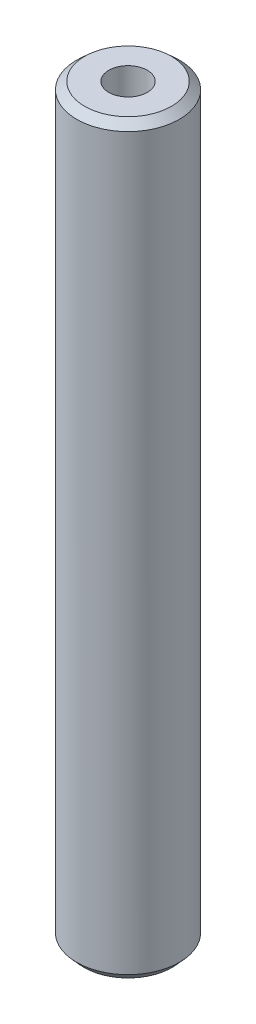
ISO-10303-21;
HEADER;
FILE_DESCRIPTION(('STEP AP214'),'2;1');
FILE_NAME('part.step','',(''),(''),'','','');
FILE_SCHEMA(('AUTOMOTIVE_DESIGN { 1 0 10303 214 1 1 1 1 }'));
ENDSEC;
DATA;
#1=APPLICATION_CONTEXT('core data for automotive mechanical design processes');
#2=APPLICATION_PROTOCOL_DEFINITION('international standard','automotive_design',2000,#1);
#3=PRODUCT_CONTEXT('',#1,'mechanical');
#4=PRODUCT('Part','Part','',(#3));
#5=PRODUCT_RELATED_PRODUCT_CATEGORY('part','',(#4));
#6=PRODUCT_DEFINITION_FORMATION('','',#4);
#7=PRODUCT_DEFINITION_CONTEXT('part definition',#1,'design');
#8=PRODUCT_DEFINITION('design','',#6,#7);
#9=PRODUCT_DEFINITION_SHAPE('','',#8);
#10=(LENGTH_UNIT() NAMED_UNIT(*) SI_UNIT(.MILLI.,.METRE.));
#11=(NAMED_UNIT(*) PLANE_ANGLE_UNIT() SI_UNIT($,.RADIAN.));
#12=(NAMED_UNIT(*) SI_UNIT($,.STERADIAN.) SOLID_ANGLE_UNIT());
#13=UNCERTAINTY_MEASURE_WITH_UNIT(LENGTH_MEASURE(1.E-05),#10,'distance_accuracy_value','');
#14=(GEOMETRIC_REPRESENTATION_CONTEXT(3) GLOBAL_UNCERTAINTY_ASSIGNED_CONTEXT((#13)) GLOBAL_UNIT_ASSIGNED_CONTEXT((#10,
#11,#12)) REPRESENTATION_CONTEXT('',''));
#15=CARTESIAN_POINT('',(0.,0.,0.));
#16=DIRECTION('',(0.,0.,1.));
#17=DIRECTION('',(1.,0.,0.));
#18=AXIS2_PLACEMENT_3D('',#15,#16,#17);
#19=CARTESIAN_POINT('',(0.,290.200484392078,0.));
#20=DIRECTION('',(0.,-1.,0.));
#21=DIRECTION('',(0.,0.,-1.));
#22=AXIS2_PLACEMENT_3D('',#19,#20,#21);
#23=CYLINDRICAL_SURFACE('',#22,20.);
#24=CARTESIAN_POINT('',(0.,287.378357114849,0.));
#25=DIRECTION('',(0.,1.,0.));
#26=DIRECTION('',(0.,0.,1.));
#27=AXIS2_PLACEMENT_3D('',#24,#25,#26);
#28=CIRCLE('',#27,20.);
#29=CARTESIAN_POINT('',(0.,287.378357114849,-20.));
#30=VERTEX_POINT('',#29);
#31=EDGE_CURVE('E50',#30,#30,#28,.F.);
#32=CARTESIAN_POINT('',(0.,3.1256314483481,0.));
#33=DIRECTION('',(0.,1.,0.));
#34=DIRECTION('',(0.,0.,1.));
#35=AXIS2_PLACEMENT_3D('',#32,#33,#34);
#36=CIRCLE('',#35,20.);
#37=CARTESIAN_POINT('',(0.,3.12563144834804,-20.));
#38=VERTEX_POINT('',#37);
#39=EDGE_CURVE('E51',#38,#38,#36,.T.);
#40=CARTESIAN_POINT('',(0.,287.378357114849,-20.));
#41=CARTESIAN_POINT('',(0.,284.41739122249,-20.));
#42=CARTESIAN_POINT('',(0.,281.45642533013,-20.));
#43=CARTESIAN_POINT('',(0.,275.534493545412,-20.));
#44=CARTESIAN_POINT('',(0.,272.573527653052,-20.));
#45=CARTESIAN_POINT('',(0.,266.651595868333,-20.));
#46=CARTESIAN_POINT('',(0.,263.690629975974,-20.));
#47=CARTESIAN_POINT('',(0.,257.768698191255,-20.));
#48=CARTESIAN_POINT('',(0.,254.807732298896,-20.));
#49=CARTESIAN_POINT('',(0.,248.885800514177,-20.));
#50=CARTESIAN_POINT('',(0.,245.924834621818,-20.));
#51=CARTESIAN_POINT('',(0.,240.002902837099,-20.));
#52=CARTESIAN_POINT('',(0.,237.04193694474,-20.));
#53=CARTESIAN_POINT('',(0.,231.120005160021,-20.));
#54=CARTESIAN_POINT('',(0.,228.159039267661,-20.));
#55=CARTESIAN_POINT('',(0.,222.237107482943,-20.));
#56=CARTESIAN_POINT('',(0.,219.276141590583,-20.));
#57=CARTESIAN_POINT('',(0.,213.354209805864,-20.));
#58=CARTESIAN_POINT('',(0.,210.393243913505,-20.));
#59=CARTESIAN_POINT('',(0.,204.471312128786,-20.));
#60=CARTESIAN_POINT('',(0.,201.510346236427,-20.));
#61=CARTESIAN_POINT('',(0.,195.588414451708,-20.));
#62=CARTESIAN_POINT('',(0.,192.627448559349,-20.));
#63=CARTESIAN_POINT('',(0.,186.70551677463,-20.));
#64=CARTESIAN_POINT('',(0.,183.744550882271,-20.));
#65=CARTESIAN_POINT('',(0.,177.822619097552,-20.));
#66=CARTESIAN_POINT('',(0.,174.861653205192,-20.));
#67=CARTESIAN_POINT('',(0.,168.939721420474,-20.));
#68=CARTESIAN_POINT('',(0.,165.978755528114,-20.));
#69=CARTESIAN_POINT('',(0.,160.056823743396,-20.));
#70=CARTESIAN_POINT('',(0.,157.095857851036,-20.));
#71=CARTESIAN_POINT('',(0.,151.173926066317,-20.));
#72=CARTESIAN_POINT('',(0.,148.212960173958,-20.));
#73=CARTESIAN_POINT('',(0.,142.291028389239,-20.));
#74=CARTESIAN_POINT('',(0.,139.33006249688,-20.));
#75=CARTESIAN_POINT('',(0.,133.408130712161,-20.));
#76=CARTESIAN_POINT('',(0.,130.447164819802,-20.));
#77=CARTESIAN_POINT('',(0.,124.525233035083,-20.));
#78=CARTESIAN_POINT('',(0.,121.564267142723,-20.));
#79=CARTESIAN_POINT('',(0.,115.642335358005,-20.));
#80=CARTESIAN_POINT('',(0.,112.681369465645,-20.));
#81=CARTESIAN_POINT('',(0.,106.759437680927,-20.));
#82=CARTESIAN_POINT('',(0.,103.798471788567,-20.));
#83=CARTESIAN_POINT('',(0.,97.8765400038484,-20.));
#84=CARTESIAN_POINT('',(0.,94.915574111489,-20.));
#85=CARTESIAN_POINT('',(0.,88.9936423267702,-20.));
#86=CARTESIAN_POINT('',(0.,86.0326764344109,-20.));
#87=CARTESIAN_POINT('',(0.,80.1107446496921,-20.));
#88=CARTESIAN_POINT('',(0.,77.1497787573327,-20.));
#89=CARTESIAN_POINT('',(0.,71.2278469726139,-20.));
#90=CARTESIAN_POINT('',(0.,68.2668810802545,-20.));
#91=CARTESIAN_POINT('',(0.,62.3449492955358,-20.));
#92=CARTESIAN_POINT('',(0.,59.3839834031764,-20.));
#93=CARTESIAN_POINT('',(0.,53.4620516184576,-20.));
#94=CARTESIAN_POINT('',(0.,50.5010857260982,-20.));
#95=CARTESIAN_POINT('',(0.,44.5791539413795,-20.));
#96=CARTESIAN_POINT('',(0.,41.6181880490201,-20.));
#97=CARTESIAN_POINT('',(0.,35.6962562643013,-20.));
#98=CARTESIAN_POINT('',(0.,32.735290371942,-20.));
#99=CARTESIAN_POINT('',(0.,26.8133585872232,-20.));
#100=CARTESIAN_POINT('',(0.,23.8523926948638,-20.));
#101=CARTESIAN_POINT('',(0.,17.930460910145,-20.));
#102=CARTESIAN_POINT('',(0.,14.9694950177856,-20.));
#103=CARTESIAN_POINT('',(0.,9.04756323306682,-20.));
#104=CARTESIAN_POINT('',(0.,6.08659734070743,-20.));
#105=CARTESIAN_POINT('',(0.,3.12563144834804,-20.));
#106=B_SPLINE_CURVE_WITH_KNOTS('',3,(#40,#41,#42,#43,#44,#45,#46,#47,#48,#49,#50,#51,#52,#53,
#54,#55,#56,#57,#58,#59,#60,#61,#62,#63,#64,#65,#66,#67,#68,#69,#70,#71,#72,#73,#74,#75,#76,#77,
#78,#79,#80,#81,#82,#83,#84,#85,#86,#87,#88,#89,#90,#91,#92,#93,#94,#95,#96,#97,#98,#99,#100,
#101,#102,#103,#104,#105),.UNSPECIFIED.,.F.,.F.,(4,2,2,2,2,2,2,2,2,2,2,2,2,2,2,2,2,2,2,2,2,2,2,
2,2,2,2,2,2,2,2,2,4),(0.,8.88289767707817,17.7657953541563,26.6486930312345,35.5315907083126,
44.4144883853908,53.297386062469,62.1802837395471,71.0631814166253,79.9460790937034,
88.8289767707816,97.7118744478598,106.594772124938,115.477669802016,124.360567479094,
133.243465156172,142.126362833251,151.009260510329,159.892158187407,168.775055864485,
177.657953541563,186.540851218641,195.423748895719,204.306646572798,213.189544249876,
222.072441926954,230.955339604032,239.83823728111,248.721134958188,257.604032635267,
266.486930312345,275.369827989423,284.252725666501),.UNSPECIFIED.);
#107=EDGE_CURVE('BSEAM39',#30,#38,#106,.T.);
#108=ORIENTED_EDGE('',*,*,#31,.T.);
#109=ORIENTED_EDGE('',*,*,#39,.T.);
#110=ORIENTED_EDGE('',*,*,#107,.T.);
#111=ORIENTED_EDGE('',*,*,#107,.F.);
#112=EDGE_LOOP('',(#108,#110,#109,#111));
#113=FACE_BOUND('',#112,.T.);
#114=ADVANCED_FACE('F39',(#113),#23,.T.);
#115=CARTESIAN_POINT('',(0.,290.200484392078,0.));
#116=DIRECTION('',(0.,1.,0.));
#117=DIRECTION('',(0.,0.,1.));
#118=AXIS2_PLACEMENT_3D('',#115,#116,#117);
#119=PLANE('',#118);
#120=CARTESIAN_POINT('',(0.,290.200484392078,0.));
#121=DIRECTION('',(0.,1.,0.));
#122=DIRECTION('',(0.,0.,1.));
#123=AXIS2_PLACEMENT_3D('',#120,#121,#122);
#124=CIRCLE('',#123,16.8743685516522);
#125=CARTESIAN_POINT('',(0.,290.200484392078,16.8743685516522));
#126=VERTEX_POINT('',#125);
#127=EDGE_CURVE('E54',#126,#126,#124,.T.);
#128=ORIENTED_EDGE('',*,*,#127,.T.);
#129=EDGE_LOOP('',(#128));
#130=FACE_BOUND('',#129,.T.);
#131=CARTESIAN_POINT('',(0.,290.200484392078,0.));
#132=DIRECTION('',(0.,1.,0.));
#133=DIRECTION('',(0.,0.,1.));
#134=AXIS2_PLACEMENT_3D('',#131,#132,#133);
#135=CIRCLE('',#134,7.48569003703351);
#136=CARTESIAN_POINT('',(0.,290.200484392078,-7.48569003703351));
#137=VERTEX_POINT('',#136);
#138=EDGE_CURVE('E58',#137,#137,#135,.T.);
#139=ORIENTED_EDGE('',*,*,#138,.F.);
#140=EDGE_LOOP('',(#139));
#141=FACE_BOUND('',#140,.T.);
#142=ADVANCED_FACE('F69',(#130,#141),#119,.T.);
#143=CARTESIAN_POINT('',(0.,0.,0.));
#144=DIRECTION('',(0.,1.,0.));
#145=DIRECTION('',(0.,0.,1.));
#146=AXIS2_PLACEMENT_3D('',#143,#144,#145);
#147=PLANE('',#146);
#148=CARTESIAN_POINT('',(0.,0.,0.));
#149=DIRECTION('',(0.,1.,0.));
#150=DIRECTION('',(0.,0.,1.));
#151=AXIS2_PLACEMENT_3D('',#148,#149,#150);
#152=CIRCLE('',#151,17.1778727227708);
#153=CARTESIAN_POINT('',(0.,0.,17.1778727227708));
#154=VERTEX_POINT('',#153);
#155=EDGE_CURVE('E10',#154,#154,#152,.F.);
#156=ORIENTED_EDGE('',*,*,#155,.T.);
#157=EDGE_LOOP('',(#156));
#158=FACE_BOUND('',#157,.T.);
#159=CARTESIAN_POINT('',(0.,0.,0.));
#160=DIRECTION('',(0.,1.,0.));
#161=DIRECTION('',(0.,0.,1.));
#162=AXIS2_PLACEMENT_3D('',#159,#160,#161);
#163=CIRCLE('',#162,7.48569003703351);
#164=CARTESIAN_POINT('',(0.,0.,-7.48569003703351));
#165=VERTEX_POINT('',#164);
#166=EDGE_CURVE('E63',#165,#165,#163,.T.);
#167=ORIENTED_EDGE('',*,*,#166,.T.);
#168=EDGE_LOOP('',(#167));
#169=FACE_BOUND('',#168,.T.);
#170=ADVANCED_FACE('F75',(#158,#169),#147,.F.);
#171=CARTESIAN_POINT('',(0.,290.200484392078,0.));
#172=DIRECTION('',(0.,-1.,0.));
#173=DIRECTION('',(0.,0.,-1.));
#174=AXIS2_PLACEMENT_3D('',#171,#172,#173);
#175=CYLINDRICAL_SURFACE('',#174,7.48569003703351);
#176=CARTESIAN_POINT('',(0.,290.200484392078,-7.48569003703351));
#177=CARTESIAN_POINT('',(0.,287.177562679661,-7.48569003703351));
#178=CARTESIAN_POINT('',(0.,284.154640967243,-7.48569003703351));
#179=CARTESIAN_POINT('',(0.,278.108797542408,-7.48569003703351));
#180=CARTESIAN_POINT('',(0.,275.085875829991,-7.48569003703351));
#181=CARTESIAN_POINT('',(0.,269.040032405156,-7.48569003703351));
#182=CARTESIAN_POINT('',(0.,266.017110692738,-7.48569003703351));
#183=CARTESIAN_POINT('',(0.,259.971267267903,-7.48569003703351));
#184=CARTESIAN_POINT('',(0.,256.948345555486,-7.48569003703351));
#185=CARTESIAN_POINT('',(0.,250.902502130651,-7.48569003703351));
#186=CARTESIAN_POINT('',(0.,247.879580418233,-7.48569003703351));
#187=CARTESIAN_POINT('',(0.,241.833736993398,-7.48569003703351));
#188=CARTESIAN_POINT('',(0.,238.810815280981,-7.48569003703351));
#189=CARTESIAN_POINT('',(0.,232.764971856146,-7.48569003703351));
#190=CARTESIAN_POINT('',(0.,229.742050143728,-7.48569003703351));
#191=CARTESIAN_POINT('',(0.,223.696206718893,-7.48569003703351));
#192=CARTESIAN_POINT('',(0.,220.673285006476,-7.48569003703351));
#193=CARTESIAN_POINT('',(0.,214.627441581641,-7.48569003703351));
#194=CARTESIAN_POINT('',(0.,211.604519869224,-7.48569003703351));
#195=CARTESIAN_POINT('',(0.,205.558676444389,-7.48569003703351));
#196=CARTESIAN_POINT('',(0.,202.535754731971,-7.48569003703351));
#197=CARTESIAN_POINT('',(0.,196.489911307136,-7.48569003703351));
#198=CARTESIAN_POINT('',(0.,193.466989594719,-7.48569003703351));
#199=CARTESIAN_POINT('',(0.,187.421146169884,-7.48569003703351));
#200=CARTESIAN_POINT('',(0.,184.398224457466,-7.48569003703351));
#201=CARTESIAN_POINT('',(0.,178.352381032631,-7.48569003703351));
#202=CARTESIAN_POINT('',(0.,175.329459320214,-7.48569003703351));
#203=CARTESIAN_POINT('',(0.,169.283615895379,-7.48569003703351));
#204=CARTESIAN_POINT('',(0.,166.260694182961,-7.48569003703351));
#205=CARTESIAN_POINT('',(0.,160.214850758126,-7.48569003703351));
#206=CARTESIAN_POINT('',(0.,157.191929045709,-7.48569003703351));
#207=CARTESIAN_POINT('',(0.,151.146085620874,-7.48569003703351));
#208=CARTESIAN_POINT('',(0.,148.123163908456,-7.48569003703351));
#209=CARTESIAN_POINT('',(0.,142.077320483621,-7.48569003703351));
#210=CARTESIAN_POINT('',(0.,139.054398771204,-7.48569003703351));
#211=CARTESIAN_POINT('',(0.,133.008555346369,-7.48569003703351));
#212=CARTESIAN_POINT('',(0.,129.985633633952,-7.48569003703351));
#213=CARTESIAN_POINT('',(0.,123.939790209117,-7.48569003703351));
#214=CARTESIAN_POINT('',(0.,120.916868496699,-7.48569003703351));
#215=CARTESIAN_POINT('',(0.,114.871025071864,-7.48569003703351));
#216=CARTESIAN_POINT('',(0.,111.848103359447,-7.48569003703351));
#217=CARTESIAN_POINT('',(0.,105.802259934612,-7.48569003703351));
#218=CARTESIAN_POINT('',(0.,102.779338222194,-7.48569003703351));
#219=CARTESIAN_POINT('',(0.,96.7334947973593,-7.48569003703351));
#220=CARTESIAN_POINT('',(0.,93.7105730849418,-7.48569003703351));
#221=CARTESIAN_POINT('',(0.,87.6647296601068,-7.48569003703351));
#222=CARTESIAN_POINT('',(0.,84.6418079476893,-7.48569003703351));
#223=CARTESIAN_POINT('',(0.,78.5959645228544,-7.48569003703351));
#224=CARTESIAN_POINT('',(0.,75.5730428104369,-7.48569003703351));
#225=CARTESIAN_POINT('',(0.,69.5271993856019,-7.48569003703351));
#226=CARTESIAN_POINT('',(0.,66.5042776731845,-7.48569003703351));
#227=CARTESIAN_POINT('',(0.,60.4584342483495,-7.48569003703351));
#228=CARTESIAN_POINT('',(0.,57.435512535932,-7.48569003703351));
#229=CARTESIAN_POINT('',(0.,51.3896691110971,-7.48569003703351));
#230=CARTESIAN_POINT('',(0.,48.3667473986796,-7.48569003703351));
#231=CARTESIAN_POINT('',(0.,42.3209039738446,-7.48569003703351));
#232=CARTESIAN_POINT('',(0.,39.2979822614272,-7.48569003703351));
#233=CARTESIAN_POINT('',(0.,33.2521388365922,-7.48569003703351));
#234=CARTESIAN_POINT('',(0.,30.2292171241748,-7.48569003703351));
#235=CARTESIAN_POINT('',(0.,24.1833736993398,-7.48569003703351));
#236=CARTESIAN_POINT('',(0.,21.1604519869223,-7.48569003703351));
#237=CARTESIAN_POINT('',(0.,15.1146085620874,-7.48569003703351));
#238=CARTESIAN_POINT('',(0.,12.0916868496699,-7.48569003703351));
#239=CARTESIAN_POINT('',(0.,6.04584342483492,-7.48569003703351));
#240=CARTESIAN_POINT('',(0.,3.02292171241743,-7.48569003703351));
#241=CARTESIAN_POINT('',(0.,0.,-7.48569003703351));
#242=B_SPLINE_CURVE_WITH_KNOTS('',3,(#176,#177,#178,#179,#180,#181,#182,#183,#184,#185,#186,
#187,#188,#189,#190,#191,#192,#193,#194,#195,#196,#197,#198,#199,#200,#201,#202,#203,#204,#205,
#206,#207,#208,#209,#210,#211,#212,#213,#214,#215,#216,#217,#218,#219,#220,#221,#222,#223,#224,
#225,#226,#227,#228,#229,#230,#231,#232,#233,#234,#235,#236,#237,#238,#239,#240,#241),
.UNSPECIFIED.,.F.,.F.,(4,2,2,2,2,2,2,2,2,2,2,2,2,2,2,2,2,2,2,2,2,2,2,2,2,2,2,2,2,2,2,2,4),(0.,
9.06876513725247,18.1375302745049,27.2062954117573,36.2750605490098,45.3438256862622,
54.4125908235147,63.4813559607671,72.5501210980196,81.618886235272,90.6876513725244,
99.7564165097769,108.825181647029,117.893946784282,126.962711921534,136.031477058787,
145.100242196039,154.169007333291,163.237772470544,172.306537607796,181.375302745049,
190.444067882301,199.512833019554,208.581598156806,217.650363294059,226.719128431311,
235.787893568563,244.856658705816,253.925423843068,262.994188980321,272.062954117573,
281.131719254826,290.200484392078),.UNSPECIFIED.);
#243=EDGE_CURVE('BSEAM70',#137,#165,#242,.T.);
#244=ORIENTED_EDGE('',*,*,#138,.T.);
#245=ORIENTED_EDGE('',*,*,#166,.F.);
#246=ORIENTED_EDGE('',*,*,#243,.T.);
#247=ORIENTED_EDGE('',*,*,#243,.F.);
#248=EDGE_LOOP('',(#244,#246,#245,#247));
#249=FACE_BOUND('',#248,.T.);
#250=ADVANCED_FACE('F70',(#249),#175,.F.);
#251=CARTESIAN_POINT('',(0.,290.200484392078,0.));
#252=DIRECTION('',(0.,-1.,0.));
#253=DIRECTION('',(0.,0.,-1.));
#254=AXIS2_PLACEMENT_3D('',#251,#252,#253);
#255=CONICAL_SURFACE('',#254,16.8743685516522,0.836382267732416);
#256=ORIENTED_EDGE('',*,*,#31,.F.);
#257=EDGE_LOOP('',(#256));
#258=FACE_BOUND('',#257,.T.);
#259=ORIENTED_EDGE('',*,*,#127,.F.);
#260=EDGE_LOOP('',(#259));
#261=FACE_BOUND('',#260,.T.);
#262=ADVANCED_FACE('F81',(#258,#261),#255,.T.);
#263=CARTESIAN_POINT('',(0.,3.1256314483481,0.));
#264=DIRECTION('',(0.,1.,0.));
#265=DIRECTION('',(0.,0.,1.));
#266=AXIS2_PLACEMENT_3D('',#263,#264,#265);
#267=CONICAL_SURFACE('',#266,20.,0.734414059062486);
#268=ORIENTED_EDGE('',*,*,#155,.F.);
#269=EDGE_LOOP('',(#268));
#270=FACE_BOUND('',#269,.T.);
#271=ORIENTED_EDGE('',*,*,#39,.F.);
#272=EDGE_LOOP('',(#271));
#273=FACE_BOUND('',#272,.T.);
#274=ADVANCED_FACE('F45',(#270,#273),#267,.T.);
#275=CLOSED_SHELL('',(#114,#142,#170,#250,#262,#274));
#276=MANIFOLD_SOLID_BREP('B2',#275);
#277=ADVANCED_BREP_SHAPE_REPRESENTATION('',(#18,#276),#14);
#278=SHAPE_DEFINITION_REPRESENTATION(#9,#277);
ENDSEC;
END-ISO-10303-21;
